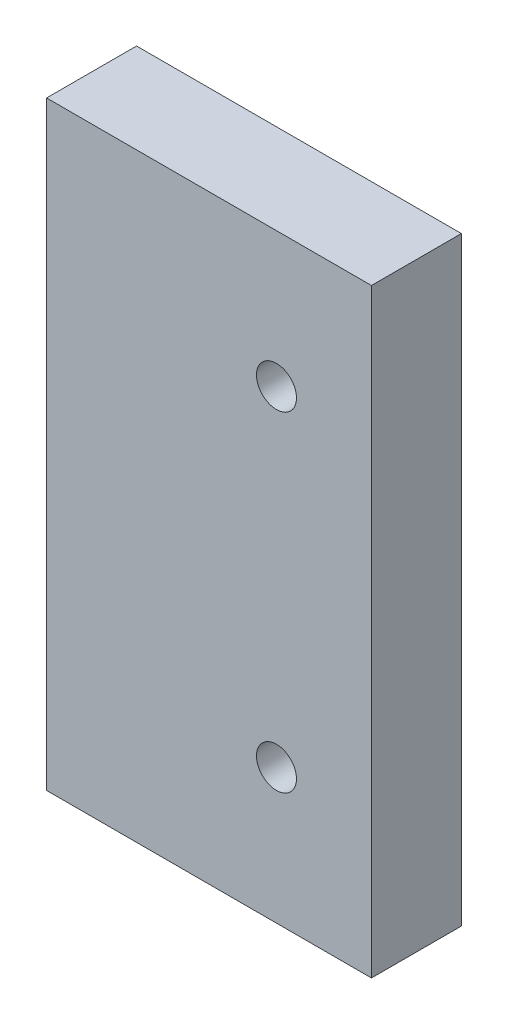
ISO-10303-21;
HEADER;
FILE_DESCRIPTION(('STEP AP214'),'2;1');
FILE_NAME('part.step','',(''),(''),'','','');
FILE_SCHEMA(('AUTOMOTIVE_DESIGN { 1 0 10303 214 1 1 1 1 }'));
ENDSEC;
DATA;
#1=APPLICATION_CONTEXT('core data for automotive mechanical design processes');
#2=APPLICATION_PROTOCOL_DEFINITION('international standard','automotive_design',2000,#1);
#3=PRODUCT_CONTEXT('',#1,'mechanical');
#4=PRODUCT('Part','Part','',(#3));
#5=PRODUCT_RELATED_PRODUCT_CATEGORY('part','',(#4));
#6=PRODUCT_DEFINITION_FORMATION('','',#4);
#7=PRODUCT_DEFINITION_CONTEXT('part definition',#1,'design');
#8=PRODUCT_DEFINITION('design','',#6,#7);
#9=PRODUCT_DEFINITION_SHAPE('','',#8);
#10=(LENGTH_UNIT() NAMED_UNIT(*) SI_UNIT(.MILLI.,.METRE.));
#11=(NAMED_UNIT(*) PLANE_ANGLE_UNIT() SI_UNIT($,.RADIAN.));
#12=(NAMED_UNIT(*) SI_UNIT($,.STERADIAN.) SOLID_ANGLE_UNIT());
#13=UNCERTAINTY_MEASURE_WITH_UNIT(LENGTH_MEASURE(1.E-05),#10,'distance_accuracy_value','');
#14=(GEOMETRIC_REPRESENTATION_CONTEXT(3) GLOBAL_UNCERTAINTY_ASSIGNED_CONTEXT((#13)) GLOBAL_UNIT_ASSIGNED_CONTEXT((#10,
#11,#12)) REPRESENTATION_CONTEXT('',''));
#15=CARTESIAN_POINT('',(0.,0.,0.));
#16=DIRECTION('',(0.,0.,1.));
#17=DIRECTION('',(1.,0.,0.));
#18=AXIS2_PLACEMENT_3D('',#15,#16,#17);
#19=CARTESIAN_POINT('',(0.,0.,18.));
#20=DIRECTION('',(0.,0.,1.));
#21=DIRECTION('',(1.,0.,0.));
#22=AXIS2_PLACEMENT_3D('',#19,#20,#21);
#23=PLANE('',#22);
#24=CARTESIAN_POINT('',(13.5,33.,18.));
#25=DIRECTION('',(0.,0.,1.));
#26=DIRECTION('',(1.,0.,0.));
#27=AXIS2_PLACEMENT_3D('',#24,#25,#26);
#28=CIRCLE('',#27,4.);
#29=CARTESIAN_POINT('',(17.5,33.,18.));
#30=VERTEX_POINT('',#29);
#31=EDGE_CURVE('E100',#30,#30,#28,.T.);
#32=ORIENTED_EDGE('',*,*,#31,.F.);
#33=EDGE_LOOP('',(#32));
#34=FACE_BOUND('',#33,.T.);
#35=DIRECTION('',(0.,1.,0.));
#36=VECTOR('',#35,1.);
#37=CARTESIAN_POINT('',(32.5,60.,18.));
#38=LINE('',#37,#36);
#39=CARTESIAN_POINT('',(32.5,-60.,18.));
#40=VERTEX_POINT('',#39);
#41=CARTESIAN_POINT('',(32.5,60.,18.));
#42=VERTEX_POINT('',#41);
#43=EDGE_CURVE('E85',#40,#42,#38,.T.);
#44=ORIENTED_EDGE('',*,*,#43,.T.);
#45=DIRECTION('',(-1.,0.,0.));
#46=VECTOR('',#45,1.);
#47=CARTESIAN_POINT('',(-32.5,60.,18.));
#48=LINE('',#47,#46);
#49=CARTESIAN_POINT('',(-32.5,60.,18.));
#50=VERTEX_POINT('',#49);
#51=EDGE_CURVE('E80',#42,#50,#48,.T.);
#52=ORIENTED_EDGE('',*,*,#51,.T.);
#53=DIRECTION('',(0.,-1.,0.));
#54=VECTOR('',#53,1.);
#55=CARTESIAN_POINT('',(-32.5,60.,18.));
#56=LINE('',#55,#54);
#57=CARTESIAN_POINT('',(-32.5,-60.,18.));
#58=VERTEX_POINT('',#57);
#59=EDGE_CURVE('E83',#50,#58,#56,.T.);
#60=ORIENTED_EDGE('',*,*,#59,.T.);
#61=DIRECTION('',(1.,0.,0.));
#62=VECTOR('',#61,1.);
#63=CARTESIAN_POINT('',(-32.5,-60.,18.));
#64=LINE('',#63,#62);
#65=EDGE_CURVE('E50',#58,#40,#64,.T.);
#66=ORIENTED_EDGE('',*,*,#65,.T.);
#67=EDGE_LOOP('',(#44,#52,#60,#66));
#68=FACE_BOUND('',#67,.T.);
#69=CARTESIAN_POINT('',(13.5,-33.,18.));
#70=DIRECTION('',(0.,0.,1.));
#71=DIRECTION('',(1.,0.,0.));
#72=AXIS2_PLACEMENT_3D('',#69,#70,#71);
#73=CIRCLE('',#72,4.);
#74=CARTESIAN_POINT('',(17.5,-33.,18.));
#75=VERTEX_POINT('',#74);
#76=EDGE_CURVE('E115',#75,#75,#73,.T.);
#77=ORIENTED_EDGE('',*,*,#76,.F.);
#78=EDGE_LOOP('',(#77));
#79=FACE_BOUND('',#78,.T.);
#80=ADVANCED_FACE('F33',(#34,#68,#79),#23,.T.);
#81=CARTESIAN_POINT('',(0.,0.,0.));
#82=DIRECTION('',(0.,0.,1.));
#83=DIRECTION('',(1.,0.,0.));
#84=AXIS2_PLACEMENT_3D('',#81,#82,#83);
#85=PLANE('',#84);
#86=DIRECTION('',(0.,1.,0.));
#87=VECTOR('',#86,1.);
#88=CARTESIAN_POINT('',(32.5,60.,0.));
#89=LINE('',#88,#87);
#90=CARTESIAN_POINT('',(32.5,-60.,0.));
#91=VERTEX_POINT('',#90);
#92=CARTESIAN_POINT('',(32.5,60.,0.));
#93=VERTEX_POINT('',#92);
#94=EDGE_CURVE('E97',#91,#93,#89,.T.);
#95=ORIENTED_EDGE('',*,*,#94,.F.);
#96=DIRECTION('',(1.,0.,0.));
#97=VECTOR('',#96,1.);
#98=CARTESIAN_POINT('',(-32.5,-60.,0.));
#99=LINE('',#98,#97);
#100=CARTESIAN_POINT('',(-32.5,-60.,0.));
#101=VERTEX_POINT('',#100);
#102=EDGE_CURVE('E73',#101,#91,#99,.T.);
#103=ORIENTED_EDGE('',*,*,#102,.F.);
#104=DIRECTION('',(0.,-1.,0.));
#105=VECTOR('',#104,1.);
#106=CARTESIAN_POINT('',(-32.5,60.,0.));
#107=LINE('',#106,#105);
#108=CARTESIAN_POINT('',(-32.5,60.,0.));
#109=VERTEX_POINT('',#108);
#110=EDGE_CURVE('E67',#109,#101,#107,.T.);
#111=ORIENTED_EDGE('',*,*,#110,.F.);
#112=DIRECTION('',(-1.,0.,0.));
#113=VECTOR('',#112,1.);
#114=CARTESIAN_POINT('',(-32.5,60.,0.));
#115=LINE('',#114,#113);
#116=EDGE_CURVE('E89',#93,#109,#115,.T.);
#117=ORIENTED_EDGE('',*,*,#116,.F.);
#118=EDGE_LOOP('',(#95,#103,#111,#117));
#119=FACE_BOUND('',#118,.T.);
#120=CARTESIAN_POINT('',(13.5,33.,0.));
#121=DIRECTION('',(0.,0.,1.));
#122=DIRECTION('',(1.,0.,0.));
#123=AXIS2_PLACEMENT_3D('',#120,#121,#122);
#124=CIRCLE('',#123,4.);
#125=CARTESIAN_POINT('',(17.5,33.,0.));
#126=VERTEX_POINT('',#125);
#127=EDGE_CURVE('E112',#126,#126,#124,.T.);
#128=ORIENTED_EDGE('',*,*,#127,.T.);
#129=EDGE_LOOP('',(#128));
#130=FACE_BOUND('',#129,.T.);
#131=CARTESIAN_POINT('',(13.5,-33.,0.));
#132=DIRECTION('',(0.,0.,1.));
#133=DIRECTION('',(1.,0.,0.));
#134=AXIS2_PLACEMENT_3D('',#131,#132,#133);
#135=CIRCLE('',#134,4.);
#136=CARTESIAN_POINT('',(17.5,-33.,0.));
#137=VERTEX_POINT('',#136);
#138=EDGE_CURVE('E118',#137,#137,#135,.T.);
#139=ORIENTED_EDGE('',*,*,#138,.T.);
#140=EDGE_LOOP('',(#139));
#141=FACE_BOUND('',#140,.T.);
#142=ADVANCED_FACE('F108',(#119,#130,#141),#85,.F.);
#143=CARTESIAN_POINT('',(32.5,60.,18.));
#144=DIRECTION('',(-1.,0.,0.));
#145=DIRECTION('',(0.,-1.,0.));
#146=AXIS2_PLACEMENT_3D('',#143,#144,#145);
#147=PLANE('',#146);
#148=ORIENTED_EDGE('',*,*,#94,.T.);
#149=DIRECTION('',(0.,0.,-1.));
#150=VECTOR('',#149,1.);
#151=CARTESIAN_POINT('',(32.5,60.,18.));
#152=LINE('',#151,#150);
#153=EDGE_CURVE('E11',#42,#93,#152,.T.);
#154=ORIENTED_EDGE('',*,*,#153,.F.);
#155=ORIENTED_EDGE('',*,*,#43,.F.);
#156=DIRECTION('',(0.,0.,-1.));
#157=VECTOR('',#156,1.);
#158=CARTESIAN_POINT('',(32.5,-60.,18.));
#159=LINE('',#158,#157);
#160=EDGE_CURVE('E93',#40,#91,#159,.T.);
#161=ORIENTED_EDGE('',*,*,#160,.T.);
#162=EDGE_LOOP('',(#148,#154,#155,#161));
#163=FACE_BOUND('',#162,.T.);
#164=ADVANCED_FACE('F35',(#163),#147,.F.);
#165=CARTESIAN_POINT('',(-32.5,60.,18.));
#166=DIRECTION('',(0.,-1.,0.));
#167=DIRECTION('',(0.,0.,-1.));
#168=AXIS2_PLACEMENT_3D('',#165,#166,#167);
#169=PLANE('',#168);
#170=ORIENTED_EDGE('',*,*,#116,.T.);
#171=DIRECTION('',(0.,0.,-1.));
#172=VECTOR('',#171,1.);
#173=CARTESIAN_POINT('',(-32.5,60.,18.));
#174=LINE('',#173,#172);
#175=EDGE_CURVE('E42',#50,#109,#174,.T.);
#176=ORIENTED_EDGE('',*,*,#175,.F.);
#177=ORIENTED_EDGE('',*,*,#51,.F.);
#178=ORIENTED_EDGE('',*,*,#153,.T.);
#179=EDGE_LOOP('',(#170,#176,#177,#178));
#180=FACE_BOUND('',#179,.T.);
#181=ADVANCED_FACE('F88',(#180),#169,.F.);
#182=CARTESIAN_POINT('',(-32.5,60.,18.));
#183=DIRECTION('',(1.,0.,0.));
#184=DIRECTION('',(0.,1.,0.));
#185=AXIS2_PLACEMENT_3D('',#182,#183,#184);
#186=PLANE('',#185);
#187=ORIENTED_EDGE('',*,*,#110,.T.);
#188=DIRECTION('',(0.,0.,-1.));
#189=VECTOR('',#188,1.);
#190=CARTESIAN_POINT('',(-32.5,-60.,18.));
#191=LINE('',#190,#189);
#192=EDGE_CURVE('E90',#58,#101,#191,.T.);
#193=ORIENTED_EDGE('',*,*,#192,.F.);
#194=ORIENTED_EDGE('',*,*,#59,.F.);
#195=ORIENTED_EDGE('',*,*,#175,.T.);
#196=EDGE_LOOP('',(#187,#193,#194,#195));
#197=FACE_BOUND('',#196,.T.);
#198=ADVANCED_FACE('F91',(#197),#186,.F.);
#199=CARTESIAN_POINT('',(-32.5,-60.,18.));
#200=DIRECTION('',(0.,1.,0.));
#201=DIRECTION('',(0.,0.,1.));
#202=AXIS2_PLACEMENT_3D('',#199,#200,#201);
#203=PLANE('',#202);
#204=ORIENTED_EDGE('',*,*,#102,.T.);
#205=ORIENTED_EDGE('',*,*,#160,.F.);
#206=ORIENTED_EDGE('',*,*,#65,.F.);
#207=ORIENTED_EDGE('',*,*,#192,.T.);
#208=EDGE_LOOP('',(#204,#205,#206,#207));
#209=FACE_BOUND('',#208,.T.);
#210=ADVANCED_FACE('F105',(#209),#203,.F.);
#211=CARTESIAN_POINT('',(13.5,33.,18.));
#212=DIRECTION('',(0.,0.,-1.));
#213=DIRECTION('',(-1.,0.,0.));
#214=AXIS2_PLACEMENT_3D('',#211,#212,#213);
#215=CYLINDRICAL_SURFACE('',#214,4.);
#216=ORIENTED_EDGE('',*,*,#31,.T.);
#217=EDGE_LOOP('',(#216));
#218=FACE_BOUND('',#217,.T.);
#219=ORIENTED_EDGE('',*,*,#127,.F.);
#220=EDGE_LOOP('',(#219));
#221=FACE_BOUND('',#220,.T.);
#222=ADVANCED_FACE('F135',(#218,#221),#215,.F.);
#223=CARTESIAN_POINT('',(13.5,-33.,18.));
#224=DIRECTION('',(0.,0.,-1.));
#225=DIRECTION('',(-1.,0.,0.));
#226=AXIS2_PLACEMENT_3D('',#223,#224,#225);
#227=CYLINDRICAL_SURFACE('',#226,4.);
#228=ORIENTED_EDGE('',*,*,#76,.T.);
#229=EDGE_LOOP('',(#228));
#230=FACE_BOUND('',#229,.T.);
#231=ORIENTED_EDGE('',*,*,#138,.F.);
#232=EDGE_LOOP('',(#231));
#233=FACE_BOUND('',#232,.T.);
#234=ADVANCED_FACE('F124',(#230,#233),#227,.F.);
#235=CLOSED_SHELL('',(#80,#142,#164,#181,#198,#210,#222,#234));
#236=MANIFOLD_SOLID_BREP('B2',#235);
#237=ADVANCED_BREP_SHAPE_REPRESENTATION('',(#18,#236),#14);
#238=SHAPE_DEFINITION_REPRESENTATION(#9,#237);
ENDSEC;
END-ISO-10303-21;
